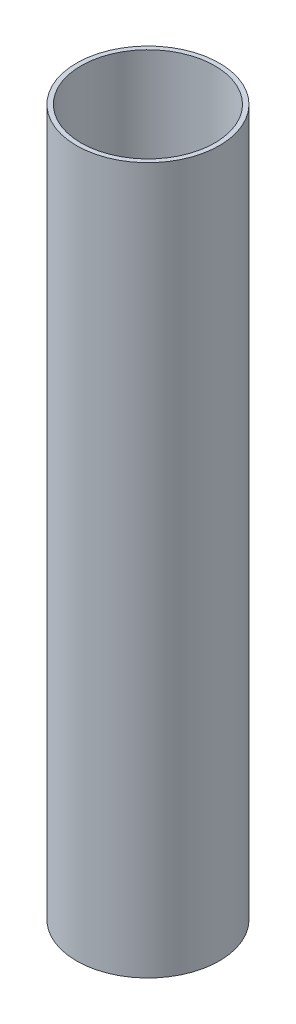
ISO-10303-21;
HEADER;
FILE_DESCRIPTION(('STEP AP214'),'2;1');
FILE_NAME('part.step','',(''),(''),'','','');
FILE_SCHEMA(('AUTOMOTIVE_DESIGN { 1 0 10303 214 1 1 1 1 }'));
ENDSEC;
DATA;
#1=APPLICATION_CONTEXT('core data for automotive mechanical design processes');
#2=APPLICATION_PROTOCOL_DEFINITION('international standard','automotive_design',2000,#1);
#3=PRODUCT_CONTEXT('',#1,'mechanical');
#4=PRODUCT('Part','Part','',(#3));
#5=PRODUCT_RELATED_PRODUCT_CATEGORY('part','',(#4));
#6=PRODUCT_DEFINITION_FORMATION('','',#4);
#7=PRODUCT_DEFINITION_CONTEXT('part definition',#1,'design');
#8=PRODUCT_DEFINITION('design','',#6,#7);
#9=PRODUCT_DEFINITION_SHAPE('','',#8);
#10=(LENGTH_UNIT() NAMED_UNIT(*) SI_UNIT(.MILLI.,.METRE.));
#11=(NAMED_UNIT(*) PLANE_ANGLE_UNIT() SI_UNIT($,.RADIAN.));
#12=(NAMED_UNIT(*) SI_UNIT($,.STERADIAN.) SOLID_ANGLE_UNIT());
#13=UNCERTAINTY_MEASURE_WITH_UNIT(LENGTH_MEASURE(1.E-05),#10,'distance_accuracy_value','');
#14=(GEOMETRIC_REPRESENTATION_CONTEXT(3) GLOBAL_UNCERTAINTY_ASSIGNED_CONTEXT((#13)) GLOBAL_UNIT_ASSIGNED_CONTEXT((#10,
#11,#12)) REPRESENTATION_CONTEXT('',''));
#15=CARTESIAN_POINT('',(0.,0.,0.));
#16=DIRECTION('',(0.,0.,1.));
#17=DIRECTION('',(1.,0.,0.));
#18=AXIS2_PLACEMENT_3D('',#15,#16,#17);
#19=CARTESIAN_POINT('',(0.,247.,0.));
#20=DIRECTION('',(0.,1.,0.));
#21=DIRECTION('',(0.,0.,1.));
#22=AXIS2_PLACEMENT_3D('',#19,#20,#21);
#23=PLANE('',#22);
#24=CARTESIAN_POINT('',(0.,247.,0.));
#25=DIRECTION('',(0.,1.,0.));
#26=DIRECTION('',(0.,0.,1.));
#27=AXIS2_PLACEMENT_3D('',#24,#25,#26);
#28=CIRCLE('',#27,25.);
#29=CARTESIAN_POINT('',(0.,247.,25.));
#30=VERTEX_POINT('',#29);
#31=EDGE_CURVE('E10',#30,#30,#28,.T.);
#32=ORIENTED_EDGE('',*,*,#31,.T.);
#33=EDGE_LOOP('',(#32));
#34=FACE_BOUND('',#33,.T.);
#35=CARTESIAN_POINT('',(0.,247.,0.));
#36=DIRECTION('',(0.,1.,0.));
#37=DIRECTION('',(0.,0.,1.));
#38=AXIS2_PLACEMENT_3D('',#35,#36,#37);
#39=CIRCLE('',#38,23.4);
#40=CARTESIAN_POINT('',(0.,247.,23.4));
#41=VERTEX_POINT('',#40);
#42=EDGE_CURVE('E52',#41,#41,#39,.T.);
#43=ORIENTED_EDGE('',*,*,#42,.F.);
#44=EDGE_LOOP('',(#43));
#45=FACE_BOUND('',#44,.T.);
#46=ADVANCED_FACE('F41',(#34,#45),#23,.T.);
#47=CARTESIAN_POINT('',(0.,0.,0.));
#48=DIRECTION('',(0.,1.,0.));
#49=DIRECTION('',(0.,0.,1.));
#50=AXIS2_PLACEMENT_3D('',#47,#48,#49);
#51=PLANE('',#50);
#52=CARTESIAN_POINT('',(0.,0.,0.));
#53=DIRECTION('',(0.,1.,0.));
#54=DIRECTION('',(0.,0.,1.));
#55=AXIS2_PLACEMENT_3D('',#52,#53,#54);
#56=CIRCLE('',#55,25.);
#57=CARTESIAN_POINT('',(0.,0.,25.));
#58=VERTEX_POINT('',#57);
#59=EDGE_CURVE('E45',#58,#58,#56,.T.);
#60=ORIENTED_EDGE('',*,*,#59,.F.);
#61=EDGE_LOOP('',(#60));
#62=FACE_BOUND('',#61,.T.);
#63=CARTESIAN_POINT('',(0.,0.,0.));
#64=DIRECTION('',(0.,1.,0.));
#65=DIRECTION('',(0.,0.,1.));
#66=AXIS2_PLACEMENT_3D('',#63,#64,#65);
#67=CIRCLE('',#66,23.4);
#68=CARTESIAN_POINT('',(0.,0.,23.4));
#69=VERTEX_POINT('',#68);
#70=EDGE_CURVE('E54',#69,#69,#67,.T.);
#71=ORIENTED_EDGE('',*,*,#70,.T.);
#72=EDGE_LOOP('',(#71));
#73=FACE_BOUND('',#72,.T.);
#74=ADVANCED_FACE('F64',(#62,#73),#51,.F.);
#75=CARTESIAN_POINT('',(0.,247.,0.));
#76=DIRECTION('',(0.,-1.,0.));
#77=DIRECTION('',(0.,0.,-1.));
#78=AXIS2_PLACEMENT_3D('',#75,#76,#77);
#79=CYLINDRICAL_SURFACE('',#78,25.);
#80=ORIENTED_EDGE('',*,*,#31,.F.);
#81=EDGE_LOOP('',(#80));
#82=FACE_BOUND('',#81,.T.);
#83=ORIENTED_EDGE('',*,*,#59,.T.);
#84=EDGE_LOOP('',(#83));
#85=FACE_BOUND('',#84,.T.);
#86=ADVANCED_FACE('F43',(#82,#85),#79,.T.);
#87=CARTESIAN_POINT('',(0.,247.,0.));
#88=DIRECTION('',(0.,-1.,0.));
#89=DIRECTION('',(0.,0.,-1.));
#90=AXIS2_PLACEMENT_3D('',#87,#88,#89);
#91=CYLINDRICAL_SURFACE('',#90,23.4);
#92=ORIENTED_EDGE('',*,*,#42,.T.);
#93=EDGE_LOOP('',(#92));
#94=FACE_BOUND('',#93,.T.);
#95=ORIENTED_EDGE('',*,*,#70,.F.);
#96=EDGE_LOOP('',(#95));
#97=FACE_BOUND('',#96,.T.);
#98=ADVANCED_FACE('F60',(#94,#97),#91,.F.);
#99=CLOSED_SHELL('',(#46,#74,#86,#98));
#100=MANIFOLD_SOLID_BREP('B2',#99);
#101=ADVANCED_BREP_SHAPE_REPRESENTATION('',(#18,#100),#14);
#102=SHAPE_DEFINITION_REPRESENTATION(#9,#101);
ENDSEC;
END-ISO-10303-21;
